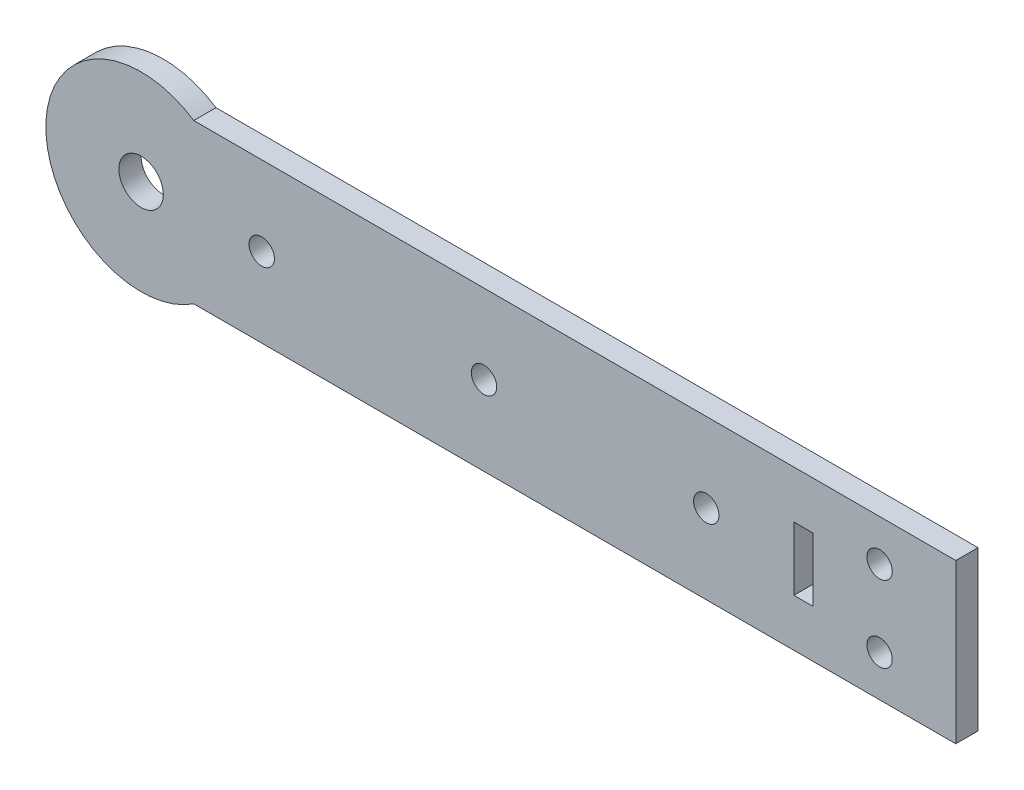
ISO-10303-21;
HEADER;
FILE_DESCRIPTION(('STEP AP214'),'2;1');
FILE_NAME('part.step','',(''),(''),'','','');
FILE_SCHEMA(('AUTOMOTIVE_DESIGN { 1 0 10303 214 1 1 1 1 }'));
ENDSEC;
DATA;
#1=APPLICATION_CONTEXT('core data for automotive mechanical design processes');
#2=APPLICATION_PROTOCOL_DEFINITION('international standard','automotive_design',2000,#1);
#3=PRODUCT_CONTEXT('',#1,'mechanical');
#4=PRODUCT('Part','Part','',(#3));
#5=PRODUCT_RELATED_PRODUCT_CATEGORY('part','',(#4));
#6=PRODUCT_DEFINITION_FORMATION('','',#4);
#7=PRODUCT_DEFINITION_CONTEXT('part definition',#1,'design');
#8=PRODUCT_DEFINITION('design','',#6,#7);
#9=PRODUCT_DEFINITION_SHAPE('','',#8);
#10=(LENGTH_UNIT() NAMED_UNIT(*) SI_UNIT(.MILLI.,.METRE.));
#11=(NAMED_UNIT(*) PLANE_ANGLE_UNIT() SI_UNIT($,.RADIAN.));
#12=(NAMED_UNIT(*) SI_UNIT($,.STERADIAN.) SOLID_ANGLE_UNIT());
#13=UNCERTAINTY_MEASURE_WITH_UNIT(LENGTH_MEASURE(1.E-05),#10,'distance_accuracy_value','');
#14=(GEOMETRIC_REPRESENTATION_CONTEXT(3) GLOBAL_UNCERTAINTY_ASSIGNED_CONTEXT((#13)) GLOBAL_UNIT_ASSIGNED_CONTEXT((#10,
#11,#12)) REPRESENTATION_CONTEXT('',''));
#15=CARTESIAN_POINT('',(0.,0.,0.));
#16=DIRECTION('',(0.,0.,1.));
#17=DIRECTION('',(1.,0.,0.));
#18=AXIS2_PLACEMENT_3D('',#15,#16,#17);
#19=CARTESIAN_POINT('',(-91.4864973933316,0.,3.5));
#20=DIRECTION('',(0.,0.,1.));
#21=DIRECTION('',(1.,0.,0.));
#22=AXIS2_PLACEMENT_3D('',#19,#20,#21);
#23=PLANE('',#22);
#24=CARTESIAN_POINT('',(-37.4864973933316,0.,3.5));
#25=DIRECTION('',(0.,0.,1.));
#26=DIRECTION('',(1.,0.,0.));
#27=AXIS2_PLACEMENT_3D('',#24,#25,#26);
#28=CIRCLE('',#27,2.);
#29=CARTESIAN_POINT('',(-35.4864973933316,0.,3.5));
#30=VERTEX_POINT('',#29);
#31=EDGE_CURVE('E165',#30,#30,#28,.T.);
#32=ORIENTED_EDGE('',*,*,#31,.F.);
#33=EDGE_LOOP('',(#32));
#34=FACE_BOUND('',#33,.T.);
#35=CARTESIAN_POINT('',(-72.4864973933316,0.,3.5));
#36=DIRECTION('',(0.,0.,1.));
#37=DIRECTION('',(1.,0.,0.));
#38=AXIS2_PLACEMENT_3D('',#35,#36,#37);
#39=CIRCLE('',#38,2.);
#40=CARTESIAN_POINT('',(-70.4864973933316,0.,3.5));
#41=VERTEX_POINT('',#40);
#42=EDGE_CURVE('E181',#41,#41,#39,.T.);
#43=ORIENTED_EDGE('',*,*,#42,.F.);
#44=EDGE_LOOP('',(#43));
#45=FACE_BOUND('',#44,.T.);
#46=CARTESIAN_POINT('',(24.8050645825569,6.,3.5));
#47=DIRECTION('',(0.,0.,1.));
#48=DIRECTION('',(1.,0.,0.));
#49=AXIS2_PLACEMENT_3D('',#46,#47,#48);
#50=CIRCLE('',#49,2.);
#51=CARTESIAN_POINT('',(26.8050645825569,6.,3.5));
#52=VERTEX_POINT('',#51);
#53=EDGE_CURVE('E197',#52,#52,#50,.T.);
#54=ORIENTED_EDGE('',*,*,#53,.F.);
#55=EDGE_LOOP('',(#54));
#56=FACE_BOUND('',#55,.T.);
#57=CARTESIAN_POINT('',(-91.4864973933316,0.,3.5));
#58=DIRECTION('',(0.,0.,1.));
#59=DIRECTION('',(1.,0.,0.));
#60=AXIS2_PLACEMENT_3D('',#57,#58,#59);
#61=CIRCLE('',#60,15.);
#62=CARTESIAN_POINT('',(-83.1949354174431,12.5,3.5));
#63=VERTEX_POINT('',#62);
#64=CARTESIAN_POINT('',(-83.1949354174431,-12.5,3.5));
#65=VERTEX_POINT('',#64);
#66=EDGE_CURVE('E205',#63,#65,#61,.T.);
#67=ORIENTED_EDGE('',*,*,#66,.T.);
#68=DIRECTION('',(1.,0.,0.));
#69=VECTOR('',#68,1.);
#70=CARTESIAN_POINT('',(-83.1949354174431,-12.5,3.5));
#71=LINE('',#70,#69);
#72=CARTESIAN_POINT('',(36.8050645825569,-12.5,3.5));
#73=VERTEX_POINT('',#72);
#74=EDGE_CURVE('E209',#65,#73,#71,.T.);
#75=ORIENTED_EDGE('',*,*,#74,.T.);
#76=DIRECTION('',(0.,1.,0.));
#77=VECTOR('',#76,1.);
#78=CARTESIAN_POINT('',(36.8050645825569,12.5,3.5));
#79=LINE('',#78,#77);
#80=CARTESIAN_POINT('',(36.8050645825569,12.5,3.5));
#81=VERTEX_POINT('',#80);
#82=EDGE_CURVE('E213',#73,#81,#79,.T.);
#83=ORIENTED_EDGE('',*,*,#82,.T.);
#84=DIRECTION('',(-1.,0.,0.));
#85=VECTOR('',#84,1.);
#86=CARTESIAN_POINT('',(-83.1949354174431,12.5,3.5));
#87=LINE('',#86,#85);
#88=EDGE_CURVE('E216',#81,#63,#87,.T.);
#89=ORIENTED_EDGE('',*,*,#88,.T.);
#90=EDGE_LOOP('',(#67,#75,#83,#89));
#91=FACE_BOUND('',#90,.T.);
#92=CARTESIAN_POINT('',(-91.4864973933316,0.,3.5));
#93=DIRECTION('',(0.,0.,1.));
#94=DIRECTION('',(1.,0.,0.));
#95=AXIS2_PLACEMENT_3D('',#92,#93,#94);
#96=CIRCLE('',#95,3.50000000000001);
#97=CARTESIAN_POINT('',(-87.9864973933316,0.,3.5));
#98=VERTEX_POINT('',#97);
#99=EDGE_CURVE('E189',#98,#98,#96,.T.);
#100=ORIENTED_EDGE('',*,*,#99,.F.);
#101=EDGE_LOOP('',(#100));
#102=FACE_BOUND('',#101,.T.);
#103=CARTESIAN_POINT('',(24.8050645825569,-6.,3.5));
#104=DIRECTION('',(0.,0.,1.));
#105=DIRECTION('',(-1.,0.,0.));
#106=AXIS2_PLACEMENT_3D('',#103,#104,#105);
#107=CIRCLE('',#106,2.);
#108=CARTESIAN_POINT('',(22.8050645825569,-6.,3.5));
#109=VERTEX_POINT('',#108);
#110=EDGE_CURVE('E173',#109,#109,#107,.T.);
#111=ORIENTED_EDGE('',*,*,#110,.F.);
#112=EDGE_LOOP('',(#111));
#113=FACE_BOUND('',#112,.T.);
#114=CARTESIAN_POINT('',(-2.48649739333161,0.,3.5));
#115=DIRECTION('',(0.,0.,1.));
#116=DIRECTION('',(1.,0.,0.));
#117=AXIS2_PLACEMENT_3D('',#114,#115,#116);
#118=CIRCLE('',#117,2.);
#119=CARTESIAN_POINT('',(-0.486497393331605,0.,3.5));
#120=VERTEX_POINT('',#119);
#121=EDGE_CURVE('E157',#120,#120,#118,.T.);
#122=ORIENTED_EDGE('',*,*,#121,.F.);
#123=EDGE_LOOP('',(#122));
#124=FACE_BOUND('',#123,.T.);
#125=DIRECTION('',(-1.,0.,0.));
#126=VECTOR('',#125,1.);
#127=CARTESIAN_POINT('',(11.3050645825569,5.,3.5));
#128=LINE('',#127,#126);
#129=CARTESIAN_POINT('',(14.3050645825569,5.,3.5));
#130=VERTEX_POINT('',#129);
#131=CARTESIAN_POINT('',(11.3050645825569,5.,3.5));
#132=VERTEX_POINT('',#131);
#133=EDGE_CURVE('E118',#130,#132,#128,.T.);
#134=ORIENTED_EDGE('',*,*,#133,.F.);
#135=DIRECTION('',(0.,1.,0.));
#136=VECTOR('',#135,1.);
#137=CARTESIAN_POINT('',(14.3050645825569,5.,3.5));
#138=LINE('',#137,#136);
#139=CARTESIAN_POINT('',(14.3050645825569,-5.,3.5));
#140=VERTEX_POINT('',#139);
#141=EDGE_CURVE('E109',#140,#130,#138,.T.);
#142=ORIENTED_EDGE('',*,*,#141,.F.);
#143=DIRECTION('',(1.,0.,0.));
#144=VECTOR('',#143,1.);
#145=CARTESIAN_POINT('',(11.3050645825569,-5.,3.5));
#146=LINE('',#145,#144);
#147=CARTESIAN_POINT('',(11.3050645825569,-5.,3.5));
#148=VERTEX_POINT('',#147);
#149=EDGE_CURVE('E135',#148,#140,#146,.T.);
#150=ORIENTED_EDGE('',*,*,#149,.F.);
#151=DIRECTION('',(0.,-1.,0.));
#152=VECTOR('',#151,1.);
#153=CARTESIAN_POINT('',(11.3050645825569,5.,3.5));
#154=LINE('',#153,#152);
#155=EDGE_CURVE('E131',#132,#148,#154,.T.);
#156=ORIENTED_EDGE('',*,*,#155,.F.);
#157=EDGE_LOOP('',(#134,#142,#150,#156));
#158=FACE_BOUND('',#157,.T.);
#159=ADVANCED_FACE('F43',(#34,#45,#56,#91,#102,#113,#124,#158),#23,.T.);
#160=CARTESIAN_POINT('',(-91.4864973933316,0.,0.));
#161=DIRECTION('',(0.,0.,1.));
#162=DIRECTION('',(1.,0.,0.));
#163=AXIS2_PLACEMENT_3D('',#160,#161,#162);
#164=PLANE('',#163);
#165=CARTESIAN_POINT('',(-2.48649739333161,0.,0.));
#166=DIRECTION('',(0.,0.,1.));
#167=DIRECTION('',(1.,0.,0.));
#168=AXIS2_PLACEMENT_3D('',#165,#166,#167);
#169=CIRCLE('',#168,2.);
#170=CARTESIAN_POINT('',(-0.486497393331605,0.,0.));
#171=VERTEX_POINT('',#170);
#172=EDGE_CURVE('E127',#171,#171,#169,.T.);
#173=ORIENTED_EDGE('',*,*,#172,.T.);
#174=EDGE_LOOP('',(#173));
#175=FACE_BOUND('',#174,.T.);
#176=CARTESIAN_POINT('',(-37.4864973933316,0.,0.));
#177=DIRECTION('',(0.,0.,1.));
#178=DIRECTION('',(1.,0.,0.));
#179=AXIS2_PLACEMENT_3D('',#176,#177,#178);
#180=CIRCLE('',#179,2.);
#181=CARTESIAN_POINT('',(-35.4864973933316,0.,0.));
#182=VERTEX_POINT('',#181);
#183=EDGE_CURVE('E161',#182,#182,#180,.T.);
#184=ORIENTED_EDGE('',*,*,#183,.T.);
#185=EDGE_LOOP('',(#184));
#186=FACE_BOUND('',#185,.T.);
#187=CARTESIAN_POINT('',(24.8050645825569,-6.,0.));
#188=DIRECTION('',(0.,0.,1.));
#189=DIRECTION('',(-1.,0.,0.));
#190=AXIS2_PLACEMENT_3D('',#187,#188,#189);
#191=CIRCLE('',#190,2.);
#192=CARTESIAN_POINT('',(22.8050645825569,-6.,0.));
#193=VERTEX_POINT('',#192);
#194=EDGE_CURVE('E169',#193,#193,#191,.T.);
#195=ORIENTED_EDGE('',*,*,#194,.T.);
#196=EDGE_LOOP('',(#195));
#197=FACE_BOUND('',#196,.T.);
#198=CARTESIAN_POINT('',(-72.4864973933316,0.,0.));
#199=DIRECTION('',(0.,0.,1.));
#200=DIRECTION('',(1.,0.,0.));
#201=AXIS2_PLACEMENT_3D('',#198,#199,#200);
#202=CIRCLE('',#201,2.);
#203=CARTESIAN_POINT('',(-70.4864973933316,0.,0.));
#204=VERTEX_POINT('',#203);
#205=EDGE_CURVE('E177',#204,#204,#202,.T.);
#206=ORIENTED_EDGE('',*,*,#205,.T.);
#207=EDGE_LOOP('',(#206));
#208=FACE_BOUND('',#207,.T.);
#209=CARTESIAN_POINT('',(-91.4864973933316,0.,0.));
#210=DIRECTION('',(0.,0.,1.));
#211=DIRECTION('',(1.,0.,0.));
#212=AXIS2_PLACEMENT_3D('',#209,#210,#211);
#213=CIRCLE('',#212,3.50000000000001);
#214=CARTESIAN_POINT('',(-87.9864973933316,0.,0.));
#215=VERTEX_POINT('',#214);
#216=EDGE_CURVE('E185',#215,#215,#213,.T.);
#217=ORIENTED_EDGE('',*,*,#216,.T.);
#218=EDGE_LOOP('',(#217));
#219=FACE_BOUND('',#218,.T.);
#220=CARTESIAN_POINT('',(24.8050645825569,6.,0.));
#221=DIRECTION('',(0.,0.,1.));
#222=DIRECTION('',(1.,0.,0.));
#223=AXIS2_PLACEMENT_3D('',#220,#221,#222);
#224=CIRCLE('',#223,2.);
#225=CARTESIAN_POINT('',(26.8050645825569,6.,0.));
#226=VERTEX_POINT('',#225);
#227=EDGE_CURVE('E193',#226,#226,#224,.T.);
#228=ORIENTED_EDGE('',*,*,#227,.T.);
#229=EDGE_LOOP('',(#228));
#230=FACE_BOUND('',#229,.T.);
#231=CARTESIAN_POINT('',(-91.4864973933316,0.,0.));
#232=DIRECTION('',(0.,0.,1.));
#233=DIRECTION('',(1.,0.,0.));
#234=AXIS2_PLACEMENT_3D('',#231,#232,#233);
#235=CIRCLE('',#234,15.);
#236=CARTESIAN_POINT('',(-83.1949354174431,12.5,0.));
#237=VERTEX_POINT('',#236);
#238=CARTESIAN_POINT('',(-83.1949354174431,-12.5,0.));
#239=VERTEX_POINT('',#238);
#240=EDGE_CURVE('E201',#237,#239,#235,.T.);
#241=ORIENTED_EDGE('',*,*,#240,.F.);
#242=DIRECTION('',(-1.,0.,0.));
#243=VECTOR('',#242,1.);
#244=CARTESIAN_POINT('',(-83.1949354174431,12.5,0.));
#245=LINE('',#244,#243);
#246=CARTESIAN_POINT('',(36.8050645825569,12.5,0.));
#247=VERTEX_POINT('',#246);
#248=EDGE_CURVE('E210',#247,#237,#245,.T.);
#249=ORIENTED_EDGE('',*,*,#248,.F.);
#250=DIRECTION('',(0.,1.,0.));
#251=VECTOR('',#250,1.);
#252=CARTESIAN_POINT('',(36.8050645825569,12.5,0.));
#253=LINE('',#252,#251);
#254=CARTESIAN_POINT('',(36.8050645825569,-12.5,0.));
#255=VERTEX_POINT('',#254);
#256=EDGE_CURVE('E226',#255,#247,#253,.T.);
#257=ORIENTED_EDGE('',*,*,#256,.F.);
#258=DIRECTION('',(1.,0.,0.));
#259=VECTOR('',#258,1.);
#260=CARTESIAN_POINT('',(-83.1949354174431,-12.5,0.));
#261=LINE('',#260,#259);
#262=EDGE_CURVE('E223',#239,#255,#261,.T.);
#263=ORIENTED_EDGE('',*,*,#262,.F.);
#264=EDGE_LOOP('',(#241,#249,#257,#263));
#265=FACE_BOUND('',#264,.T.);
#266=DIRECTION('',(0.,1.,0.));
#267=VECTOR('',#266,1.);
#268=CARTESIAN_POINT('',(14.3050645825569,5.,0.));
#269=LINE('',#268,#267);
#270=CARTESIAN_POINT('',(14.3050645825569,-5.,0.));
#271=VERTEX_POINT('',#270);
#272=CARTESIAN_POINT('',(14.3050645825569,5.,0.));
#273=VERTEX_POINT('',#272);
#274=EDGE_CURVE('E67',#271,#273,#269,.T.);
#275=ORIENTED_EDGE('',*,*,#274,.T.);
#276=DIRECTION('',(-1.,0.,0.));
#277=VECTOR('',#276,1.);
#278=CARTESIAN_POINT('',(11.3050645825569,5.,0.));
#279=LINE('',#278,#277);
#280=CARTESIAN_POINT('',(11.3050645825569,5.,0.));
#281=VERTEX_POINT('',#280);
#282=EDGE_CURVE('E125',#273,#281,#279,.T.);
#283=ORIENTED_EDGE('',*,*,#282,.T.);
#284=DIRECTION('',(0.,-1.,0.));
#285=VECTOR('',#284,1.);
#286=CARTESIAN_POINT('',(11.3050645825569,5.,0.));
#287=LINE('',#286,#285);
#288=CARTESIAN_POINT('',(11.3050645825569,-5.,0.));
#289=VERTEX_POINT('',#288);
#290=EDGE_CURVE('E144',#281,#289,#287,.T.);
#291=ORIENTED_EDGE('',*,*,#290,.T.);
#292=DIRECTION('',(1.,0.,0.));
#293=VECTOR('',#292,1.);
#294=CARTESIAN_POINT('',(11.3050645825569,-5.,0.));
#295=LINE('',#294,#293);
#296=EDGE_CURVE('E119',#289,#271,#295,.T.);
#297=ORIENTED_EDGE('',*,*,#296,.T.);
#298=EDGE_LOOP('',(#275,#283,#291,#297));
#299=FACE_BOUND('',#298,.T.);
#300=ADVANCED_FACE('F249',(#175,#186,#197,#208,#219,#230,#265,#299),#164,.F.);
#301=CARTESIAN_POINT('',(-91.4864973933316,0.,3.5));
#302=DIRECTION('',(0.,0.,-1.));
#303=DIRECTION('',(-1.,0.,0.));
#304=AXIS2_PLACEMENT_3D('',#301,#302,#303);
#305=CYLINDRICAL_SURFACE('',#304,15.);
#306=ORIENTED_EDGE('',*,*,#240,.T.);
#307=DIRECTION('',(0.,0.,-1.));
#308=VECTOR('',#307,1.);
#309=CARTESIAN_POINT('',(-83.1949354174431,-12.5,3.5));
#310=LINE('',#309,#308);
#311=EDGE_CURVE('E11',#65,#239,#310,.T.);
#312=ORIENTED_EDGE('',*,*,#311,.F.);
#313=ORIENTED_EDGE('',*,*,#66,.F.);
#314=DIRECTION('',(0.,0.,-1.));
#315=VECTOR('',#314,1.);
#316=CARTESIAN_POINT('',(-83.1949354174431,12.5,3.5));
#317=LINE('',#316,#315);
#318=EDGE_CURVE('E219',#63,#237,#317,.T.);
#319=ORIENTED_EDGE('',*,*,#318,.T.);
#320=EDGE_LOOP('',(#306,#312,#313,#319));
#321=FACE_BOUND('',#320,.T.);
#322=ADVANCED_FACE('F45',(#321),#305,.T.);
#323=CARTESIAN_POINT('',(-83.1949354174431,-12.5,3.5));
#324=DIRECTION('',(0.,1.,0.));
#325=DIRECTION('',(0.,0.,1.));
#326=AXIS2_PLACEMENT_3D('',#323,#324,#325);
#327=PLANE('',#326);
#328=ORIENTED_EDGE('',*,*,#262,.T.);
#329=DIRECTION('',(0.,0.,-1.));
#330=VECTOR('',#329,1.);
#331=CARTESIAN_POINT('',(36.8050645825569,-12.5,3.5));
#332=LINE('',#331,#330);
#333=EDGE_CURVE('E52',#73,#255,#332,.T.);
#334=ORIENTED_EDGE('',*,*,#333,.F.);
#335=ORIENTED_EDGE('',*,*,#74,.F.);
#336=ORIENTED_EDGE('',*,*,#311,.T.);
#337=EDGE_LOOP('',(#328,#334,#335,#336));
#338=FACE_BOUND('',#337,.T.);
#339=ADVANCED_FACE('F260',(#338),#327,.F.);
#340=CARTESIAN_POINT('',(36.8050645825569,12.5,3.5));
#341=DIRECTION('',(-1.,0.,0.));
#342=DIRECTION('',(0.,0.,1.));
#343=AXIS2_PLACEMENT_3D('',#340,#341,#342);
#344=PLANE('',#343);
#345=ORIENTED_EDGE('',*,*,#256,.T.);
#346=DIRECTION('',(0.,0.,-1.));
#347=VECTOR('',#346,1.);
#348=CARTESIAN_POINT('',(36.8050645825569,12.5,3.5));
#349=LINE('',#348,#347);
#350=EDGE_CURVE('E234',#81,#247,#349,.T.);
#351=ORIENTED_EDGE('',*,*,#350,.F.);
#352=ORIENTED_EDGE('',*,*,#82,.F.);
#353=ORIENTED_EDGE('',*,*,#333,.T.);
#354=EDGE_LOOP('',(#345,#351,#352,#353));
#355=FACE_BOUND('',#354,.T.);
#356=ADVANCED_FACE('F243',(#355),#344,.F.);
#357=CARTESIAN_POINT('',(-83.1949354174431,12.5,3.5));
#358=DIRECTION('',(0.,-1.,0.));
#359=DIRECTION('',(0.,0.,-1.));
#360=AXIS2_PLACEMENT_3D('',#357,#358,#359);
#361=PLANE('',#360);
#362=ORIENTED_EDGE('',*,*,#248,.T.);
#363=ORIENTED_EDGE('',*,*,#318,.F.);
#364=ORIENTED_EDGE('',*,*,#88,.F.);
#365=ORIENTED_EDGE('',*,*,#350,.T.);
#366=EDGE_LOOP('',(#362,#363,#364,#365));
#367=FACE_BOUND('',#366,.T.);
#368=ADVANCED_FACE('F253',(#367),#361,.F.);
#369=CARTESIAN_POINT('',(24.8050645825569,6.,3.5));
#370=DIRECTION('',(0.,0.,-1.));
#371=DIRECTION('',(-1.,0.,0.));
#372=AXIS2_PLACEMENT_3D('',#369,#370,#371);
#373=CYLINDRICAL_SURFACE('',#372,2.);
#374=ORIENTED_EDGE('',*,*,#53,.T.);
#375=EDGE_LOOP('',(#374));
#376=FACE_BOUND('',#375,.T.);
#377=ORIENTED_EDGE('',*,*,#227,.F.);
#378=EDGE_LOOP('',(#377));
#379=FACE_BOUND('',#378,.T.);
#380=ADVANCED_FACE('F278',(#376,#379),#373,.F.);
#381=CARTESIAN_POINT('',(-91.4864973933316,0.,3.5));
#382=DIRECTION('',(0.,0.,-1.));
#383=DIRECTION('',(-1.,0.,0.));
#384=AXIS2_PLACEMENT_3D('',#381,#382,#383);
#385=CYLINDRICAL_SURFACE('',#384,3.50000000000001);
#386=ORIENTED_EDGE('',*,*,#99,.T.);
#387=EDGE_LOOP('',(#386));
#388=FACE_BOUND('',#387,.T.);
#389=ORIENTED_EDGE('',*,*,#216,.F.);
#390=EDGE_LOOP('',(#389));
#391=FACE_BOUND('',#390,.T.);
#392=ADVANCED_FACE('F285',(#388,#391),#385,.F.);
#393=CARTESIAN_POINT('',(-72.4864973933316,0.,3.5));
#394=DIRECTION('',(0.,0.,-1.));
#395=DIRECTION('',(-1.,0.,0.));
#396=AXIS2_PLACEMENT_3D('',#393,#394,#395);
#397=CYLINDRICAL_SURFACE('',#396,2.);
#398=ORIENTED_EDGE('',*,*,#42,.T.);
#399=EDGE_LOOP('',(#398));
#400=FACE_BOUND('',#399,.T.);
#401=ORIENTED_EDGE('',*,*,#205,.F.);
#402=EDGE_LOOP('',(#401));
#403=FACE_BOUND('',#402,.T.);
#404=ADVANCED_FACE('F290',(#400,#403),#397,.F.);
#405=CARTESIAN_POINT('',(24.8050645825569,-6.,3.5));
#406=DIRECTION('',(0.,0.,-1.));
#407=DIRECTION('',(-1.,0.,0.));
#408=AXIS2_PLACEMENT_3D('',#405,#406,#407);
#409=CYLINDRICAL_SURFACE('',#408,2.);
#410=ORIENTED_EDGE('',*,*,#110,.T.);
#411=EDGE_LOOP('',(#410));
#412=FACE_BOUND('',#411,.T.);
#413=ORIENTED_EDGE('',*,*,#194,.F.);
#414=EDGE_LOOP('',(#413));
#415=FACE_BOUND('',#414,.T.);
#416=ADVANCED_FACE('F300',(#412,#415),#409,.F.);
#417=CARTESIAN_POINT('',(-37.4864973933316,0.,3.5));
#418=DIRECTION('',(0.,0.,-1.));
#419=DIRECTION('',(-1.,0.,0.));
#420=AXIS2_PLACEMENT_3D('',#417,#418,#419);
#421=CYLINDRICAL_SURFACE('',#420,2.);
#422=ORIENTED_EDGE('',*,*,#31,.T.);
#423=EDGE_LOOP('',(#422));
#424=FACE_BOUND('',#423,.T.);
#425=ORIENTED_EDGE('',*,*,#183,.F.);
#426=EDGE_LOOP('',(#425));
#427=FACE_BOUND('',#426,.T.);
#428=ADVANCED_FACE('F307',(#424,#427),#421,.F.);
#429=CARTESIAN_POINT('',(-2.48649739333161,0.,3.5));
#430=DIRECTION('',(0.,0.,-1.));
#431=DIRECTION('',(-1.,0.,0.));
#432=AXIS2_PLACEMENT_3D('',#429,#430,#431);
#433=CYLINDRICAL_SURFACE('',#432,2.);
#434=ORIENTED_EDGE('',*,*,#121,.T.);
#435=EDGE_LOOP('',(#434));
#436=FACE_BOUND('',#435,.T.);
#437=ORIENTED_EDGE('',*,*,#172,.F.);
#438=EDGE_LOOP('',(#437));
#439=FACE_BOUND('',#438,.T.);
#440=ADVANCED_FACE('F311',(#436,#439),#433,.F.);
#441=CARTESIAN_POINT('',(14.3050645825569,5.,3.5));
#442=DIRECTION('',(-1.,0.,0.));
#443=DIRECTION('',(0.,0.,1.));
#444=AXIS2_PLACEMENT_3D('',#441,#442,#443);
#445=PLANE('',#444);
#446=ORIENTED_EDGE('',*,*,#274,.F.);
#447=DIRECTION('',(0.,0.,-1.));
#448=VECTOR('',#447,1.);
#449=CARTESIAN_POINT('',(14.3050645825569,-5.,3.5));
#450=LINE('',#449,#448);
#451=EDGE_CURVE('E113',#140,#271,#450,.T.);
#452=ORIENTED_EDGE('',*,*,#451,.F.);
#453=ORIENTED_EDGE('',*,*,#141,.T.);
#454=DIRECTION('',(0.,0.,-1.));
#455=VECTOR('',#454,1.);
#456=CARTESIAN_POINT('',(14.3050645825569,5.,3.5));
#457=LINE('',#456,#455);
#458=EDGE_CURVE('E112',#130,#273,#457,.T.);
#459=ORIENTED_EDGE('',*,*,#458,.T.);
#460=EDGE_LOOP('',(#446,#452,#453,#459));
#461=FACE_BOUND('',#460,.T.);
#462=ADVANCED_FACE('F111',(#461),#445,.T.);
#463=CARTESIAN_POINT('',(11.3050645825569,5.,3.5));
#464=DIRECTION('',(0.,-1.,0.));
#465=DIRECTION('',(0.,0.,-1.));
#466=AXIS2_PLACEMENT_3D('',#463,#464,#465);
#467=PLANE('',#466);
#468=ORIENTED_EDGE('',*,*,#282,.F.);
#469=ORIENTED_EDGE('',*,*,#458,.F.);
#470=ORIENTED_EDGE('',*,*,#133,.T.);
#471=DIRECTION('',(0.,0.,-1.));
#472=VECTOR('',#471,1.);
#473=CARTESIAN_POINT('',(11.3050645825569,5.,3.5));
#474=LINE('',#473,#472);
#475=EDGE_CURVE('E128',#132,#281,#474,.T.);
#476=ORIENTED_EDGE('',*,*,#475,.T.);
#477=EDGE_LOOP('',(#468,#469,#470,#476));
#478=FACE_BOUND('',#477,.T.);
#479=ADVANCED_FACE('F122',(#478),#467,.T.);
#480=CARTESIAN_POINT('',(11.3050645825569,5.,3.5));
#481=DIRECTION('',(1.,0.,0.));
#482=DIRECTION('',(0.,0.,-1.));
#483=AXIS2_PLACEMENT_3D('',#480,#481,#482);
#484=PLANE('',#483);
#485=ORIENTED_EDGE('',*,*,#290,.F.);
#486=ORIENTED_EDGE('',*,*,#475,.F.);
#487=ORIENTED_EDGE('',*,*,#155,.T.);
#488=DIRECTION('',(0.,0.,-1.));
#489=VECTOR('',#488,1.);
#490=CARTESIAN_POINT('',(11.3050645825569,-5.,3.5));
#491=LINE('',#490,#489);
#492=EDGE_CURVE('E59',#148,#289,#491,.T.);
#493=ORIENTED_EDGE('',*,*,#492,.T.);
#494=EDGE_LOOP('',(#485,#486,#487,#493));
#495=FACE_BOUND('',#494,.T.);
#496=ADVANCED_FACE('F320',(#495),#484,.T.);
#497=CARTESIAN_POINT('',(11.3050645825569,-5.,3.5));
#498=DIRECTION('',(0.,1.,0.));
#499=DIRECTION('',(0.,0.,1.));
#500=AXIS2_PLACEMENT_3D('',#497,#498,#499);
#501=PLANE('',#500);
#502=ORIENTED_EDGE('',*,*,#296,.F.);
#503=ORIENTED_EDGE('',*,*,#492,.F.);
#504=ORIENTED_EDGE('',*,*,#149,.T.);
#505=ORIENTED_EDGE('',*,*,#451,.T.);
#506=EDGE_LOOP('',(#502,#503,#504,#505));
#507=FACE_BOUND('',#506,.T.);
#508=ADVANCED_FACE('F323',(#507),#501,.T.);
#509=CLOSED_SHELL('',(#159,#300,#322,#339,#356,#368,#380,#392,#404,#416,#428,#440,#462,#479,
#496,#508));
#510=MANIFOLD_SOLID_BREP('B2',#509);
#511=ADVANCED_BREP_SHAPE_REPRESENTATION('',(#18,#510),#14);
#512=SHAPE_DEFINITION_REPRESENTATION(#9,#511);
ENDSEC;
END-ISO-10303-21;
